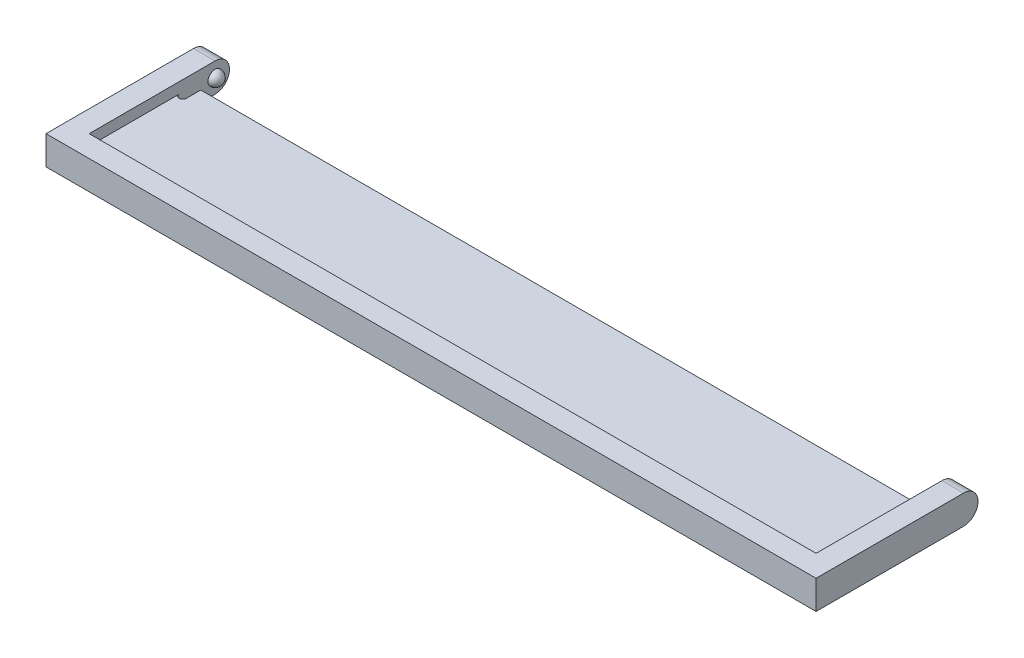
ISO-10303-21;
HEADER;
FILE_DESCRIPTION(('STEP AP214'),'2;1');
FILE_NAME('part.step','',(''),(''),'','','');
FILE_SCHEMA(('AUTOMOTIVE_DESIGN { 1 0 10303 214 1 1 1 1 }'));
ENDSEC;
DATA;
#1=APPLICATION_CONTEXT('core data for automotive mechanical design processes');
#2=APPLICATION_PROTOCOL_DEFINITION('international standard','automotive_design',2000,#1);
#3=PRODUCT_CONTEXT('',#1,'mechanical');
#4=PRODUCT('Part','Part','',(#3));
#5=PRODUCT_RELATED_PRODUCT_CATEGORY('part','',(#4));
#6=PRODUCT_DEFINITION_FORMATION('','',#4);
#7=PRODUCT_DEFINITION_CONTEXT('part definition',#1,'design');
#8=PRODUCT_DEFINITION('design','',#6,#7);
#9=PRODUCT_DEFINITION_SHAPE('','',#8);
#10=(LENGTH_UNIT() NAMED_UNIT(*) SI_UNIT(.MILLI.,.METRE.));
#11=(NAMED_UNIT(*) PLANE_ANGLE_UNIT() SI_UNIT($,.RADIAN.));
#12=(NAMED_UNIT(*) SI_UNIT($,.STERADIAN.) SOLID_ANGLE_UNIT());
#13=UNCERTAINTY_MEASURE_WITH_UNIT(LENGTH_MEASURE(1.E-05),#10,'distance_accuracy_value','');
#14=(GEOMETRIC_REPRESENTATION_CONTEXT(3) GLOBAL_UNCERTAINTY_ASSIGNED_CONTEXT((#13)) GLOBAL_UNIT_ASSIGNED_CONTEXT((#10,
#11,#12)) REPRESENTATION_CONTEXT('',''));
#15=CARTESIAN_POINT('',(0.,0.,0.));
#16=DIRECTION('',(0.,0.,1.));
#17=DIRECTION('',(1.,0.,0.));
#18=AXIS2_PLACEMENT_3D('',#15,#16,#17);
#19=CARTESIAN_POINT('',(35.81605633386,-6.,-26.0544436152008));
#20=DIRECTION('',(0.,1.,0.));
#21=DIRECTION('',(0.,0.,1.));
#22=AXIS2_PLACEMENT_3D('',#19,#20,#21);
#23=CYLINDRICAL_SURFACE('',#22,0.500000000000004);
#24=CARTESIAN_POINT('',(35.81605633386,2.5,-26.0544436152008));
#25=DIRECTION('',(0.,1.,0.));
#26=DIRECTION('',(0.,0.,1.));
#27=AXIS2_PLACEMENT_3D('',#24,#25,#26);
#28=CIRCLE('',#27,0.500000000000004);
#29=CARTESIAN_POINT('',(36.31605633386,2.5,-26.0544436152008));
#30=VERTEX_POINT('',#29);
#31=CARTESIAN_POINT('',(35.31605633386,2.5,-26.0544436152008));
#32=VERTEX_POINT('',#31);
#33=EDGE_CURVE('E198',#30,#32,#28,.F.);
#34=ORIENTED_EDGE('',*,*,#33,.F.);
#35=DIRECTION('',(0.,1.,0.));
#36=VECTOR('',#35,1.);
#37=CARTESIAN_POINT('',(36.31605633386,-6.,-26.0544436152008));
#38=LINE('',#37,#36);
#39=CARTESIAN_POINT('',(36.31605633386,0.,-26.0544436152008));
#40=VERTEX_POINT('',#39);
#41=EDGE_CURVE('E202',#40,#30,#38,.T.);
#42=ORIENTED_EDGE('',*,*,#41,.F.);
#43=CARTESIAN_POINT('',(35.81605633386,0.,-26.0544436152008));
#44=DIRECTION('',(0.,-1.,0.));
#45=DIRECTION('',(0.,0.,-1.));
#46=AXIS2_PLACEMENT_3D('',#43,#44,#45);
#47=CIRCLE('',#46,0.500000000000004);
#48=CARTESIAN_POINT('',(35.31605633386,0.,-26.0544436152008));
#49=VERTEX_POINT('',#48);
#50=EDGE_CURVE('E280',#40,#49,#47,.T.);
#51=ORIENTED_EDGE('',*,*,#50,.T.);
#52=DIRECTION('',(0.,1.,0.));
#53=VECTOR('',#52,1.);
#54=CARTESIAN_POINT('',(35.31605633386,-6.,-26.0544436152008));
#55=LINE('',#54,#53);
#56=EDGE_CURVE('E207',#49,#32,#55,.T.);
#57=ORIENTED_EDGE('',*,*,#56,.T.);
#58=EDGE_LOOP('',(#34,#42,#51,#57));
#59=FACE_BOUND('',#58,.T.);
#60=ADVANCED_FACE('F43',(#59),#23,.F.);
#61=CARTESIAN_POINT('',(35.31605633386,-6.,0.));
#62=DIRECTION('',(-1.,0.,0.));
#63=DIRECTION('',(0.,0.,1.));
#64=AXIS2_PLACEMENT_3D('',#61,#62,#63);
#65=PLANE('',#64);
#66=DIRECTION('',(0.,0.,-1.));
#67=VECTOR('',#66,1.);
#68=CARTESIAN_POINT('',(35.31605633386,2.5,0.));
#69=LINE('',#68,#67);
#70=CARTESIAN_POINT('',(35.31605633386,2.5,-28.0544436152008));
#71=VERTEX_POINT('',#70);
#72=EDGE_CURVE('E195',#32,#71,#69,.T.);
#73=ORIENTED_EDGE('',*,*,#72,.F.);
#74=ORIENTED_EDGE('',*,*,#56,.F.);
#75=DIRECTION('',(0.,0.,-1.));
#76=VECTOR('',#75,1.);
#77=CARTESIAN_POINT('',(35.31605633386,0.,0.));
#78=LINE('',#77,#76);
#79=CARTESIAN_POINT('',(35.31605633386,0.,-28.0544436152008));
#80=VERTEX_POINT('',#79);
#81=EDGE_CURVE('E277',#49,#80,#78,.T.);
#82=ORIENTED_EDGE('',*,*,#81,.T.);
#83=DIRECTION('',(0.,1.,0.));
#84=VECTOR('',#83,1.);
#85=CARTESIAN_POINT('',(35.31605633386,-6.,-28.0544436152008));
#86=LINE('',#85,#84);
#87=EDGE_CURVE('E211',#80,#71,#86,.T.);
#88=ORIENTED_EDGE('',*,*,#87,.T.);
#89=EDGE_LOOP('',(#73,#74,#82,#88));
#90=FACE_BOUND('',#89,.T.);
#91=ADVANCED_FACE('F349',(#90),#65,.F.);
#92=CARTESIAN_POINT('',(0.,-6.,-28.0544436152008));
#93=DIRECTION('',(0.,0.,1.));
#94=DIRECTION('',(1.,0.,0.));
#95=AXIS2_PLACEMENT_3D('',#92,#93,#94);
#96=PLANE('',#95);
#97=DIRECTION('',(-1.,0.,0.));
#98=VECTOR('',#97,1.);
#99=CARTESIAN_POINT('',(0.,2.5,-28.0544436152008));
#100=LINE('',#99,#98);
#101=CARTESIAN_POINT('',(-63.68394366614,2.5,-28.0544436152008));
#102=VERTEX_POINT('',#101);
#103=EDGE_CURVE('E192',#71,#102,#100,.T.);
#104=ORIENTED_EDGE('',*,*,#103,.F.);
#105=ORIENTED_EDGE('',*,*,#87,.F.);
#106=DIRECTION('',(-1.,0.,0.));
#107=VECTOR('',#106,1.);
#108=CARTESIAN_POINT('',(0.,0.,-28.0544436152008));
#109=LINE('',#108,#107);
#110=CARTESIAN_POINT('',(-63.68394366614,0.,-28.0544436152008));
#111=VERTEX_POINT('',#110);
#112=EDGE_CURVE('E274',#80,#111,#109,.T.);
#113=ORIENTED_EDGE('',*,*,#112,.T.);
#114=DIRECTION('',(0.,1.,0.));
#115=VECTOR('',#114,1.);
#116=CARTESIAN_POINT('',(-63.68394366614,-6.,-28.0544436152008));
#117=LINE('',#116,#115);
#118=EDGE_CURVE('E215',#111,#102,#117,.T.);
#119=ORIENTED_EDGE('',*,*,#118,.T.);
#120=EDGE_LOOP('',(#104,#105,#113,#119));
#121=FACE_BOUND('',#120,.T.);
#122=ADVANCED_FACE('F355',(#121),#96,.F.);
#123=CARTESIAN_POINT('',(-63.6839436661398,-6.,4.41896128481749E-13));
#124=DIRECTION('',(-1.,0.,0.));
#125=DIRECTION('',(0.,0.,1.));
#126=AXIS2_PLACEMENT_3D('',#123,#124,#125);
#127=PLANE('',#126);
#128=DIRECTION('',(0.,1.,0.));
#129=VECTOR('',#128,1.);
#130=CARTESIAN_POINT('',(-63.68394366614,-6.,-26.0544436152008));
#131=LINE('',#130,#129);
#132=CARTESIAN_POINT('',(-63.68394366614,0.,-26.0544436152008));
#133=VERTEX_POINT('',#132);
#134=CARTESIAN_POINT('',(-63.68394366614,2.5,-26.0544436152008));
#135=VERTEX_POINT('',#134);
#136=EDGE_CURVE('E219',#133,#135,#131,.T.);
#137=ORIENTED_EDGE('',*,*,#136,.T.);
#138=DIRECTION('',(0.,0.,-1.));
#139=VECTOR('',#138,1.);
#140=CARTESIAN_POINT('',(-63.6839436661398,2.5,4.41896128481749E-13));
#141=LINE('',#140,#139);
#142=EDGE_CURVE('E58',#135,#102,#141,.T.);
#143=ORIENTED_EDGE('',*,*,#142,.T.);
#144=ORIENTED_EDGE('',*,*,#118,.F.);
#145=DIRECTION('',(0.,0.,-1.));
#146=VECTOR('',#145,1.);
#147=CARTESIAN_POINT('',(-63.6839436661398,0.,4.41896128481749E-13));
#148=LINE('',#147,#146);
#149=EDGE_CURVE('E270',#133,#111,#148,.T.);
#150=ORIENTED_EDGE('',*,*,#149,.F.);
#151=EDGE_LOOP('',(#137,#143,#144,#150));
#152=FACE_BOUND('',#151,.T.);
#153=ADVANCED_FACE('F362',(#152),#127,.T.);
#154=CARTESIAN_POINT('',(-64.18394366614,-6.,-26.0544436152008));
#155=DIRECTION('',(0.,1.,0.));
#156=DIRECTION('',(0.,0.,1.));
#157=AXIS2_PLACEMENT_3D('',#154,#155,#156);
#158=CYLINDRICAL_SURFACE('',#157,0.500000000000007);
#159=CARTESIAN_POINT('',(-64.18394366614,2.5,-26.0544436152008));
#160=DIRECTION('',(0.,1.,0.));
#161=DIRECTION('',(0.,0.,1.));
#162=AXIS2_PLACEMENT_3D('',#159,#160,#161);
#163=CIRCLE('',#162,0.500000000000007);
#164=CARTESIAN_POINT('',(-64.68394366614,2.5,-26.0544436152008));
#165=VERTEX_POINT('',#164);
#166=EDGE_CURVE('E11',#135,#165,#163,.F.);
#167=ORIENTED_EDGE('',*,*,#166,.F.);
#168=ORIENTED_EDGE('',*,*,#136,.F.);
#169=CARTESIAN_POINT('',(-64.18394366614,0.,-26.0544436152008));
#170=DIRECTION('',(0.,-1.,0.));
#171=DIRECTION('',(0.,0.,-1.));
#172=AXIS2_PLACEMENT_3D('',#169,#170,#171);
#173=CIRCLE('',#172,0.500000000000007);
#174=CARTESIAN_POINT('',(-64.68394366614,0.,-26.0544436152008));
#175=VERTEX_POINT('',#174);
#176=EDGE_CURVE('E266',#133,#175,#173,.T.);
#177=ORIENTED_EDGE('',*,*,#176,.T.);
#178=DIRECTION('',(0.,1.,0.));
#179=VECTOR('',#178,1.);
#180=CARTESIAN_POINT('',(-64.68394366614,-6.,-26.0544436152008));
#181=LINE('',#180,#179);
#182=EDGE_CURVE('E223',#175,#165,#181,.T.);
#183=ORIENTED_EDGE('',*,*,#182,.T.);
#184=EDGE_LOOP('',(#167,#168,#177,#183));
#185=FACE_BOUND('',#184,.T.);
#186=ADVANCED_FACE('F366',(#185),#158,.F.);
#187=CARTESIAN_POINT('',(0.,4.,0.));
#188=DIRECTION('',(0.,-1.,0.));
#189=DIRECTION('',(0.,0.,-1.));
#190=AXIS2_PLACEMENT_3D('',#187,#188,#189);
#191=PLANE('',#190);
#192=DIRECTION('',(1.,0.,0.));
#193=VECTOR('',#192,1.);
#194=CARTESIAN_POINT('',(-64.68394366614,4.,-13.5544436152008));
#195=LINE('',#194,#193);
#196=CARTESIAN_POINT('',(-64.68394366614,4.,-13.5544436152008));
#197=VERTEX_POINT('',#196);
#198=CARTESIAN_POINT('',(36.31605633386,4.,-13.5544436152008));
#199=VERTEX_POINT('',#198);
#200=EDGE_CURVE('E164',#197,#199,#195,.T.);
#201=ORIENTED_EDGE('',*,*,#200,.F.);
#202=DIRECTION('',(0.,0.,-1.));
#203=VECTOR('',#202,1.);
#204=CARTESIAN_POINT('',(-64.68394366614,4.,-30.0544436152008));
#205=LINE('',#204,#203);
#206=CARTESIAN_POINT('',(-64.68394366614,4.,-31.0544436152008));
#207=VERTEX_POINT('',#206);
#208=EDGE_CURVE('E170',#197,#207,#205,.T.);
#209=ORIENTED_EDGE('',*,*,#208,.T.);
#210=DIRECTION('',(-1.,0.,0.));
#211=VECTOR('',#210,1.);
#212=CARTESIAN_POINT('',(0.,4.,-31.0544436152008));
#213=LINE('',#212,#211);
#214=CARTESIAN_POINT('',(-67.68394366614,4.,-31.0544436152008));
#215=VERTEX_POINT('',#214);
#216=EDGE_CURVE('E306',#207,#215,#213,.T.);
#217=ORIENTED_EDGE('',*,*,#216,.T.);
#218=DIRECTION('',(0.,0.,1.));
#219=VECTOR('',#218,1.);
#220=CARTESIAN_POINT('',(-67.68394366614,4.,-30.0544436152008));
#221=LINE('',#220,#219);
#222=CARTESIAN_POINT('',(-67.68394366614,4.,-10.5544436152008));
#223=VERTEX_POINT('',#222);
#224=EDGE_CURVE('E227',#215,#223,#221,.T.);
#225=ORIENTED_EDGE('',*,*,#224,.T.);
#226=DIRECTION('',(1.,0.,0.));
#227=VECTOR('',#226,1.);
#228=CARTESIAN_POINT('',(-67.68394366614,4.,-10.5544436152008));
#229=LINE('',#228,#227);
#230=CARTESIAN_POINT('',(39.31605633386,4.,-10.5544436152008));
#231=VERTEX_POINT('',#230);
#232=EDGE_CURVE('E230',#223,#231,#229,.T.);
#233=ORIENTED_EDGE('',*,*,#232,.T.);
#234=DIRECTION('',(0.,0.,-1.));
#235=VECTOR('',#234,1.);
#236=CARTESIAN_POINT('',(39.31605633386,4.,-30.0544436152008));
#237=LINE('',#236,#235);
#238=CARTESIAN_POINT('',(39.31605633386,4.,-31.0544436152008));
#239=VERTEX_POINT('',#238);
#240=EDGE_CURVE('E234',#231,#239,#237,.T.);
#241=ORIENTED_EDGE('',*,*,#240,.T.);
#242=DIRECTION('',(-1.,0.,0.));
#243=VECTOR('',#242,1.);
#244=CARTESIAN_POINT('',(0.,4.,-31.0544436152008));
#245=LINE('',#244,#243);
#246=CARTESIAN_POINT('',(36.31605633386,4.,-31.0544436152008));
#247=VERTEX_POINT('',#246);
#248=EDGE_CURVE('E303',#239,#247,#245,.T.);
#249=ORIENTED_EDGE('',*,*,#248,.T.);
#250=DIRECTION('',(0.,0.,1.));
#251=VECTOR('',#250,1.);
#252=CARTESIAN_POINT('',(36.31605633386,4.,-30.0544436152008));
#253=LINE('',#252,#251);
#254=EDGE_CURVE('E238',#247,#199,#253,.T.);
#255=ORIENTED_EDGE('',*,*,#254,.T.);
#256=EDGE_LOOP('',(#201,#209,#217,#225,#233,#241,#249,#255));
#257=FACE_BOUND('',#256,.T.);
#258=ADVANCED_FACE('F370',(#257),#191,.F.);
#259=CARTESIAN_POINT('',(0.,0.,0.));
#260=DIRECTION('',(0.,-1.,0.));
#261=DIRECTION('',(0.,0.,-1.));
#262=AXIS2_PLACEMENT_3D('',#259,#260,#261);
#263=PLANE('',#262);
#264=DIRECTION('',(0.,0.,1.));
#265=VECTOR('',#264,1.);
#266=CARTESIAN_POINT('',(-67.68394366614,0.,-30.0544436152008));
#267=LINE('',#266,#265);
#268=CARTESIAN_POINT('',(-67.68394366614,0.,-31.0544436152008));
#269=VERTEX_POINT('',#268);
#270=CARTESIAN_POINT('',(-67.68394366614,0.,-10.5544436152008));
#271=VERTEX_POINT('',#270);
#272=EDGE_CURVE('E206',#269,#271,#267,.T.);
#273=ORIENTED_EDGE('',*,*,#272,.F.);
#274=DIRECTION('',(-1.,0.,0.));
#275=VECTOR('',#274,1.);
#276=CARTESIAN_POINT('',(-64.68394366614,0.,-31.0544436152008));
#277=LINE('',#276,#275);
#278=CARTESIAN_POINT('',(-64.68394366614,0.,-31.0544436152008));
#279=VERTEX_POINT('',#278);
#280=EDGE_CURVE('E293',#269,#279,#277,.F.);
#281=ORIENTED_EDGE('',*,*,#280,.T.);
#282=DIRECTION('',(0.,0.,-1.));
#283=VECTOR('',#282,1.);
#284=CARTESIAN_POINT('',(-64.68394366614,0.,-30.0544436152008));
#285=LINE('',#284,#283);
#286=EDGE_CURVE('E231',#175,#279,#285,.T.);
#287=ORIENTED_EDGE('',*,*,#286,.F.);
#288=ORIENTED_EDGE('',*,*,#176,.F.);
#289=ORIENTED_EDGE('',*,*,#149,.T.);
#290=ORIENTED_EDGE('',*,*,#112,.F.);
#291=ORIENTED_EDGE('',*,*,#81,.F.);
#292=ORIENTED_EDGE('',*,*,#50,.F.);
#293=DIRECTION('',(0.,0.,1.));
#294=VECTOR('',#293,1.);
#295=CARTESIAN_POINT('',(36.31605633386,0.,-30.0544436152008));
#296=LINE('',#295,#294);
#297=CARTESIAN_POINT('',(36.31605633386,0.,-31.0544436152008));
#298=VERTEX_POINT('',#297);
#299=EDGE_CURVE('E253',#298,#40,#296,.T.);
#300=ORIENTED_EDGE('',*,*,#299,.F.);
#301=DIRECTION('',(-1.,0.,0.));
#302=VECTOR('',#301,1.);
#303=CARTESIAN_POINT('',(39.31605633386,0.,-31.0544436152008));
#304=LINE('',#303,#302);
#305=CARTESIAN_POINT('',(39.31605633386,0.,-31.0544436152008));
#306=VERTEX_POINT('',#305);
#307=EDGE_CURVE('E289',#298,#306,#304,.F.);
#308=ORIENTED_EDGE('',*,*,#307,.T.);
#309=DIRECTION('',(0.,0.,-1.));
#310=VECTOR('',#309,1.);
#311=CARTESIAN_POINT('',(39.31605633386,0.,-30.0544436152008));
#312=LINE('',#311,#310);
#313=CARTESIAN_POINT('',(39.31605633386,0.,-10.5544436152008));
#314=VERTEX_POINT('',#313);
#315=EDGE_CURVE('E250',#314,#306,#312,.T.);
#316=ORIENTED_EDGE('',*,*,#315,.F.);
#317=DIRECTION('',(1.,0.,0.));
#318=VECTOR('',#317,1.);
#319=CARTESIAN_POINT('',(-67.68394366614,0.,-10.5544436152008));
#320=LINE('',#319,#318);
#321=EDGE_CURVE('E246',#271,#314,#320,.T.);
#322=ORIENTED_EDGE('',*,*,#321,.F.);
#323=EDGE_LOOP('',(#273,#281,#287,#288,#289,#290,#291,#292,#300,#308,#316,#322));
#324=FACE_BOUND('',#323,.T.);
#325=ADVANCED_FACE('F374',(#324),#263,.T.);
#326=CARTESIAN_POINT('',(-67.68394366614,4.,-30.0544436152008));
#327=DIRECTION('',(1.,0.,0.));
#328=DIRECTION('',(0.,0.,-1.));
#329=AXIS2_PLACEMENT_3D('',#326,#327,#328);
#330=PLANE('',#329);
#331=CARTESIAN_POINT('',(-67.68394366614,2.,-31.0544436152008));
#332=DIRECTION('',(1.,0.,0.));
#333=DIRECTION('',(0.,0.,-1.));
#334=AXIS2_PLACEMENT_3D('',#331,#332,#333);
#335=CIRCLE('',#334,2.);
#336=CARTESIAN_POINT('',(-67.68394366614,2.,-33.0544436152008));
#337=VERTEX_POINT('',#336);
#338=EDGE_CURVE('E283',#215,#337,#335,.F.);
#339=ORIENTED_EDGE('',*,*,#338,.T.);
#340=CARTESIAN_POINT('',(-67.68394366614,2.,-31.0544436152008));
#341=DIRECTION('',(1.,0.,0.));
#342=DIRECTION('',(0.,0.,-1.));
#343=AXIS2_PLACEMENT_3D('',#340,#341,#342);
#344=CIRCLE('',#343,2.);
#345=EDGE_CURVE('E286',#337,#269,#344,.F.);
#346=ORIENTED_EDGE('',*,*,#345,.T.);
#347=ORIENTED_EDGE('',*,*,#272,.T.);
#348=DIRECTION('',(0.,-1.,0.));
#349=VECTOR('',#348,1.);
#350=CARTESIAN_POINT('',(-67.68394366614,4.,-10.5544436152008));
#351=LINE('',#350,#349);
#352=EDGE_CURVE('E262',#223,#271,#351,.T.);
#353=ORIENTED_EDGE('',*,*,#352,.F.);
#354=ORIENTED_EDGE('',*,*,#224,.F.);
#355=EDGE_LOOP('',(#339,#346,#347,#353,#354));
#356=FACE_BOUND('',#355,.T.);
#357=ADVANCED_FACE('F378',(#356),#330,.F.);
#358=CARTESIAN_POINT('',(-67.68394366614,4.,-10.5544436152008));
#359=DIRECTION('',(0.,0.,-1.));
#360=DIRECTION('',(-1.,0.,0.));
#361=AXIS2_PLACEMENT_3D('',#358,#359,#360);
#362=PLANE('',#361);
#363=ORIENTED_EDGE('',*,*,#321,.T.);
#364=DIRECTION('',(0.,-1.,0.));
#365=VECTOR('',#364,1.);
#366=CARTESIAN_POINT('',(39.31605633386,4.,-10.5544436152008));
#367=LINE('',#366,#365);
#368=EDGE_CURVE('E243',#231,#314,#367,.T.);
#369=ORIENTED_EDGE('',*,*,#368,.F.);
#370=ORIENTED_EDGE('',*,*,#232,.F.);
#371=ORIENTED_EDGE('',*,*,#352,.T.);
#372=EDGE_LOOP('',(#363,#369,#370,#371));
#373=FACE_BOUND('',#372,.T.);
#374=ADVANCED_FACE('F390',(#373),#362,.F.);
#375=CARTESIAN_POINT('',(39.31605633386,4.,-30.0544436152008));
#376=DIRECTION('',(-1.,0.,0.));
#377=DIRECTION('',(0.,0.,1.));
#378=AXIS2_PLACEMENT_3D('',#375,#376,#377);
#379=PLANE('',#378);
#380=ORIENTED_EDGE('',*,*,#315,.T.);
#381=CARTESIAN_POINT('',(39.31605633386,2.,-31.0544436152008));
#382=DIRECTION('',(-1.,0.,0.));
#383=DIRECTION('',(0.,0.,1.));
#384=AXIS2_PLACEMENT_3D('',#381,#382,#383);
#385=CIRCLE('',#384,2.);
#386=CARTESIAN_POINT('',(39.31605633386,2.,-33.0544436152008));
#387=VERTEX_POINT('',#386);
#388=EDGE_CURVE('E66',#306,#387,#385,.F.);
#389=ORIENTED_EDGE('',*,*,#388,.T.);
#390=CARTESIAN_POINT('',(39.31605633386,2.,-31.0544436152008));
#391=DIRECTION('',(-1.,0.,0.));
#392=DIRECTION('',(0.,0.,1.));
#393=AXIS2_PLACEMENT_3D('',#390,#391,#392);
#394=CIRCLE('',#393,2.);
#395=EDGE_CURVE('E315',#387,#239,#394,.F.);
#396=ORIENTED_EDGE('',*,*,#395,.T.);
#397=ORIENTED_EDGE('',*,*,#240,.F.);
#398=ORIENTED_EDGE('',*,*,#368,.T.);
#399=EDGE_LOOP('',(#380,#389,#396,#397,#398));
#400=FACE_BOUND('',#399,.T.);
#401=ADVANCED_FACE('F386',(#400),#379,.F.);
#402=CARTESIAN_POINT('',(36.31605633386,4.,-30.0544436152008));
#403=DIRECTION('',(1.,0.,0.));
#404=DIRECTION('',(0.,0.,-1.));
#405=AXIS2_PLACEMENT_3D('',#402,#403,#404);
#406=PLANE('',#405);
#407=DIRECTION('',(0.,1.,0.));
#408=VECTOR('',#407,1.);
#409=CARTESIAN_POINT('',(36.31605633386,2.5,-13.5544436152008));
#410=LINE('',#409,#408);
#411=CARTESIAN_POINT('',(36.31605633386,2.5,-13.5544436152008));
#412=VERTEX_POINT('',#411);
#413=EDGE_CURVE('E175',#412,#199,#410,.T.);
#414=ORIENTED_EDGE('',*,*,#413,.T.);
#415=ORIENTED_EDGE('',*,*,#254,.F.);
#416=CARTESIAN_POINT('',(36.31605633386,2.,-31.0544436152008));
#417=DIRECTION('',(1.,0.,0.));
#418=DIRECTION('',(0.,0.,-1.));
#419=AXIS2_PLACEMENT_3D('',#416,#417,#418);
#420=CIRCLE('',#419,2.);
#421=CARTESIAN_POINT('',(36.31605633386,2.,-33.0544436152008));
#422=VERTEX_POINT('',#421);
#423=EDGE_CURVE('E309',#247,#422,#420,.F.);
#424=ORIENTED_EDGE('',*,*,#423,.T.);
#425=CARTESIAN_POINT('',(36.31605633386,2.,-31.0544436152008));
#426=DIRECTION('',(1.,0.,0.));
#427=DIRECTION('',(0.,0.,-1.));
#428=AXIS2_PLACEMENT_3D('',#425,#426,#427);
#429=CIRCLE('',#428,2.);
#430=EDGE_CURVE('E312',#422,#298,#429,.F.);
#431=ORIENTED_EDGE('',*,*,#430,.T.);
#432=ORIENTED_EDGE('',*,*,#299,.T.);
#433=ORIENTED_EDGE('',*,*,#41,.T.);
#434=DIRECTION('',(0.,0.,-1.));
#435=VECTOR('',#434,1.);
#436=CARTESIAN_POINT('',(36.31605633386,2.5,-29.6257113306572));
#437=LINE('',#436,#435);
#438=EDGE_CURVE('E176',#412,#30,#437,.T.);
#439=ORIENTED_EDGE('',*,*,#438,.F.);
#440=EDGE_LOOP('',(#414,#415,#424,#431,#432,#433,#439));
#441=FACE_BOUND('',#440,.T.);
#442=CARTESIAN_POINT('',(36.31605633386,2.,-31.0544436152008));
#443=DIRECTION('',(1.,0.,0.));
#444=DIRECTION('',(0.,0.,-1.));
#445=AXIS2_PLACEMENT_3D('',#442,#443,#444);
#446=CIRCLE('',#445,1.);
#447=CARTESIAN_POINT('',(36.31605633386,2.,-32.0544436152008));
#448=VERTEX_POINT('',#447);
#449=EDGE_CURVE('E201',#448,#448,#446,.T.);
#450=ORIENTED_EDGE('',*,*,#449,.T.);
#451=EDGE_LOOP('',(#450));
#452=FACE_BOUND('',#451,.T.);
#453=ADVANCED_FACE('F333',(#441,#452),#406,.F.);
#454=CARTESIAN_POINT('',(-64.68394366614,4.,-30.0544436152008));
#455=DIRECTION('',(-1.,0.,0.));
#456=DIRECTION('',(0.,0.,1.));
#457=AXIS2_PLACEMENT_3D('',#454,#455,#456);
#458=PLANE('',#457);
#459=CARTESIAN_POINT('',(-64.68394366614,2.,-31.0544436152008));
#460=DIRECTION('',(-1.,0.,0.));
#461=DIRECTION('',(0.,0.,1.));
#462=AXIS2_PLACEMENT_3D('',#459,#460,#461);
#463=CIRCLE('',#462,1.);
#464=CARTESIAN_POINT('',(-64.68394366614,2.,-30.0544436152008));
#465=VERTEX_POINT('',#464);
#466=EDGE_CURVE('E52',#465,#465,#463,.F.);
#467=ORIENTED_EDGE('',*,*,#466,.F.);
#468=EDGE_LOOP('',(#467));
#469=FACE_BOUND('',#468,.T.);
#470=CARTESIAN_POINT('',(-64.68394366614,2.,-31.0544436152008));
#471=DIRECTION('',(-1.,0.,0.));
#472=DIRECTION('',(0.,0.,1.));
#473=AXIS2_PLACEMENT_3D('',#470,#471,#472);
#474=CIRCLE('',#473,2.);
#475=CARTESIAN_POINT('',(-64.68394366614,2.,-33.0544436152008));
#476=VERTEX_POINT('',#475);
#477=EDGE_CURVE('E297',#476,#207,#474,.F.);
#478=ORIENTED_EDGE('',*,*,#477,.T.);
#479=ORIENTED_EDGE('',*,*,#208,.F.);
#480=DIRECTION('',(0.,1.,0.));
#481=VECTOR('',#480,1.);
#482=CARTESIAN_POINT('',(-64.68394366614,2.5,-13.5544436152008));
#483=LINE('',#482,#481);
#484=CARTESIAN_POINT('',(-64.68394366614,2.5,-13.5544436152008));
#485=VERTEX_POINT('',#484);
#486=EDGE_CURVE('E167',#485,#197,#483,.T.);
#487=ORIENTED_EDGE('',*,*,#486,.F.);
#488=DIRECTION('',(0.,0.,1.));
#489=VECTOR('',#488,1.);
#490=CARTESIAN_POINT('',(-64.68394366614,2.5,-29.6257113306572));
#491=LINE('',#490,#489);
#492=EDGE_CURVE('E155',#165,#485,#491,.T.);
#493=ORIENTED_EDGE('',*,*,#492,.F.);
#494=ORIENTED_EDGE('',*,*,#182,.F.);
#495=ORIENTED_EDGE('',*,*,#286,.T.);
#496=CARTESIAN_POINT('',(-64.68394366614,2.,-31.0544436152008));
#497=DIRECTION('',(-1.,0.,0.));
#498=DIRECTION('',(0.,0.,1.));
#499=AXIS2_PLACEMENT_3D('',#496,#497,#498);
#500=CIRCLE('',#499,2.);
#501=EDGE_CURVE('E300',#279,#476,#500,.F.);
#502=ORIENTED_EDGE('',*,*,#501,.T.);
#503=EDGE_LOOP('',(#478,#479,#487,#493,#494,#495,#502));
#504=FACE_BOUND('',#503,.T.);
#505=ADVANCED_FACE('F169',(#469,#504),#458,.F.);
#506=CARTESIAN_POINT('',(0.,2.,-31.0544436152008));
#507=DIRECTION('',(-1.,0.,0.));
#508=DIRECTION('',(0.,0.,1.));
#509=AXIS2_PLACEMENT_3D('',#506,#507,#508);
#510=CYLINDRICAL_SURFACE('',#509,2.);
#511=ORIENTED_EDGE('',*,*,#216,.F.);
#512=ORIENTED_EDGE('',*,*,#477,.F.);
#513=DIRECTION('',(-1.,0.,0.));
#514=VECTOR('',#513,1.);
#515=CARTESIAN_POINT('',(-67.68394366614,2.,-33.0544436152008));
#516=LINE('',#515,#514);
#517=EDGE_CURVE('E226',#337,#476,#516,.F.);
#518=ORIENTED_EDGE('',*,*,#517,.F.);
#519=ORIENTED_EDGE('',*,*,#338,.F.);
#520=EDGE_LOOP('',(#511,#512,#518,#519));
#521=FACE_BOUND('',#520,.T.);
#522=ADVANCED_FACE('F382',(#521),#510,.T.);
#523=CARTESIAN_POINT('',(-67.68394366614,2.,-31.0544436152008));
#524=DIRECTION('',(1.,0.,0.));
#525=DIRECTION('',(0.,0.,-1.));
#526=AXIS2_PLACEMENT_3D('',#523,#524,#525);
#527=CYLINDRICAL_SURFACE('',#526,2.);
#528=ORIENTED_EDGE('',*,*,#501,.F.);
#529=ORIENTED_EDGE('',*,*,#280,.F.);
#530=ORIENTED_EDGE('',*,*,#345,.F.);
#531=ORIENTED_EDGE('',*,*,#517,.T.);
#532=EDGE_LOOP('',(#528,#529,#530,#531));
#533=FACE_BOUND('',#532,.T.);
#534=ADVANCED_FACE('F397',(#533),#527,.T.);
#535=CARTESIAN_POINT('',(0.,2.,-31.0544436152008));
#536=DIRECTION('',(-1.,0.,0.));
#537=DIRECTION('',(0.,0.,1.));
#538=AXIS2_PLACEMENT_3D('',#535,#536,#537);
#539=CYLINDRICAL_SURFACE('',#538,2.);
#540=ORIENTED_EDGE('',*,*,#248,.F.);
#541=ORIENTED_EDGE('',*,*,#395,.F.);
#542=DIRECTION('',(-1.,0.,0.));
#543=VECTOR('',#542,1.);
#544=CARTESIAN_POINT('',(39.31605633386,2.,-33.0544436152008));
#545=LINE('',#544,#543);
#546=EDGE_CURVE('E323',#422,#387,#545,.F.);
#547=ORIENTED_EDGE('',*,*,#546,.F.);
#548=ORIENTED_EDGE('',*,*,#423,.F.);
#549=EDGE_LOOP('',(#540,#541,#547,#548));
#550=FACE_BOUND('',#549,.T.);
#551=ADVANCED_FACE('F45',(#550),#539,.T.);
#552=CARTESIAN_POINT('',(39.31605633386,2.,-31.0544436152008));
#553=DIRECTION('',(1.,0.,0.));
#554=DIRECTION('',(0.,0.,-1.));
#555=AXIS2_PLACEMENT_3D('',#552,#553,#554);
#556=CYLINDRICAL_SURFACE('',#555,2.);
#557=ORIENTED_EDGE('',*,*,#388,.F.);
#558=ORIENTED_EDGE('',*,*,#307,.F.);
#559=ORIENTED_EDGE('',*,*,#430,.F.);
#560=ORIENTED_EDGE('',*,*,#546,.T.);
#561=EDGE_LOOP('',(#557,#558,#559,#560));
#562=FACE_BOUND('',#561,.T.);
#563=ADVANCED_FACE('F344',(#562),#556,.T.);
#564=CARTESIAN_POINT('',(-64.68394366614,2.,-31.0544436152008));
#565=DIRECTION('',(0.,0.,-1.));
#566=DIRECTION('',(0.,-1.,0.));
#567=AXIS2_PLACEMENT_3D('',#564,#565,#566);
#568=SPHERICAL_SURFACE('',#567,1.);
#569=CARTESIAN_POINT('',(-64.68394366614,2.,-31.0544436152008));
#570=DIRECTION('',(-1.,0.,0.));
#571=DIRECTION('',(0.,0.,1.));
#572=AXIS2_PLACEMENT_3D('',#569,#570,#571);
#573=SPHERICAL_SURFACE('',#572,1.);
#574=ORIENTED_EDGE('',*,*,#466,.T.);
#575=EDGE_LOOP('',(#574));
#576=FACE_BOUND('',#575,.T.);
#577=ADVANCED_FACE('F337',(#576),#573,.T.);
#578=CARTESIAN_POINT('',(36.31605633386,2.,-31.0544436152008));
#579=DIRECTION('',(0.,0.,-1.));
#580=DIRECTION('',(0.,-1.,0.));
#581=AXIS2_PLACEMENT_3D('',#578,#579,#580);
#582=SPHERICAL_SURFACE('',#581,1.);
#583=CARTESIAN_POINT('',(36.31605633386,2.,-31.0544436152008));
#584=DIRECTION('',(1.,0.,0.));
#585=DIRECTION('',(0.,0.,-1.));
#586=AXIS2_PLACEMENT_3D('',#583,#584,#585);
#587=SPHERICAL_SURFACE('',#586,1.);
#588=ORIENTED_EDGE('',*,*,#449,.F.);
#589=EDGE_LOOP('',(#588));
#590=FACE_BOUND('',#589,.T.);
#591=ADVANCED_FACE('F335',(#590),#587,.T.);
#592=CARTESIAN_POINT('',(0.,2.5,0.));
#593=DIRECTION('',(0.,1.,0.));
#594=DIRECTION('',(0.,0.,1.));
#595=AXIS2_PLACEMENT_3D('',#592,#593,#594);
#596=PLANE('',#595);
#597=ORIENTED_EDGE('',*,*,#33,.T.);
#598=ORIENTED_EDGE('',*,*,#72,.T.);
#599=ORIENTED_EDGE('',*,*,#103,.T.);
#600=ORIENTED_EDGE('',*,*,#142,.F.);
#601=ORIENTED_EDGE('',*,*,#166,.T.);
#602=ORIENTED_EDGE('',*,*,#492,.T.);
#603=DIRECTION('',(1.,0.,0.));
#604=VECTOR('',#603,1.);
#605=CARTESIAN_POINT('',(-64.68394366614,2.5,-13.5544436152008));
#606=LINE('',#605,#604);
#607=EDGE_CURVE('E159',#485,#412,#606,.T.);
#608=ORIENTED_EDGE('',*,*,#607,.T.);
#609=ORIENTED_EDGE('',*,*,#438,.T.);
#610=EDGE_LOOP('',(#597,#598,#599,#600,#601,#602,#608,#609));
#611=FACE_BOUND('',#610,.T.);
#612=ADVANCED_FACE('F157',(#611),#596,.T.);
#613=CARTESIAN_POINT('',(-64.68394366614,2.5,-13.5544436152008));
#614=DIRECTION('',(0.,0.,1.));
#615=DIRECTION('',(1.,0.,0.));
#616=AXIS2_PLACEMENT_3D('',#613,#614,#615);
#617=PLANE('',#616);
#618=ORIENTED_EDGE('',*,*,#200,.T.);
#619=ORIENTED_EDGE('',*,*,#413,.F.);
#620=ORIENTED_EDGE('',*,*,#607,.F.);
#621=ORIENTED_EDGE('',*,*,#486,.T.);
#622=EDGE_LOOP('',(#618,#619,#620,#621));
#623=FACE_BOUND('',#622,.T.);
#624=ADVANCED_FACE('F178',(#623),#617,.F.);
#625=CLOSED_SHELL('',(#60,#91,#122,#153,#186,#258,#325,#357,#374,#401,#453,#505,#522,#534,#551,
#563,#577,#591,#612,#624));
#626=MANIFOLD_SOLID_BREP('B2',#625);
#627=ADVANCED_BREP_SHAPE_REPRESENTATION('',(#18,#626),#14);
#628=SHAPE_DEFINITION_REPRESENTATION(#9,#627);
ENDSEC;
END-ISO-10303-21;
